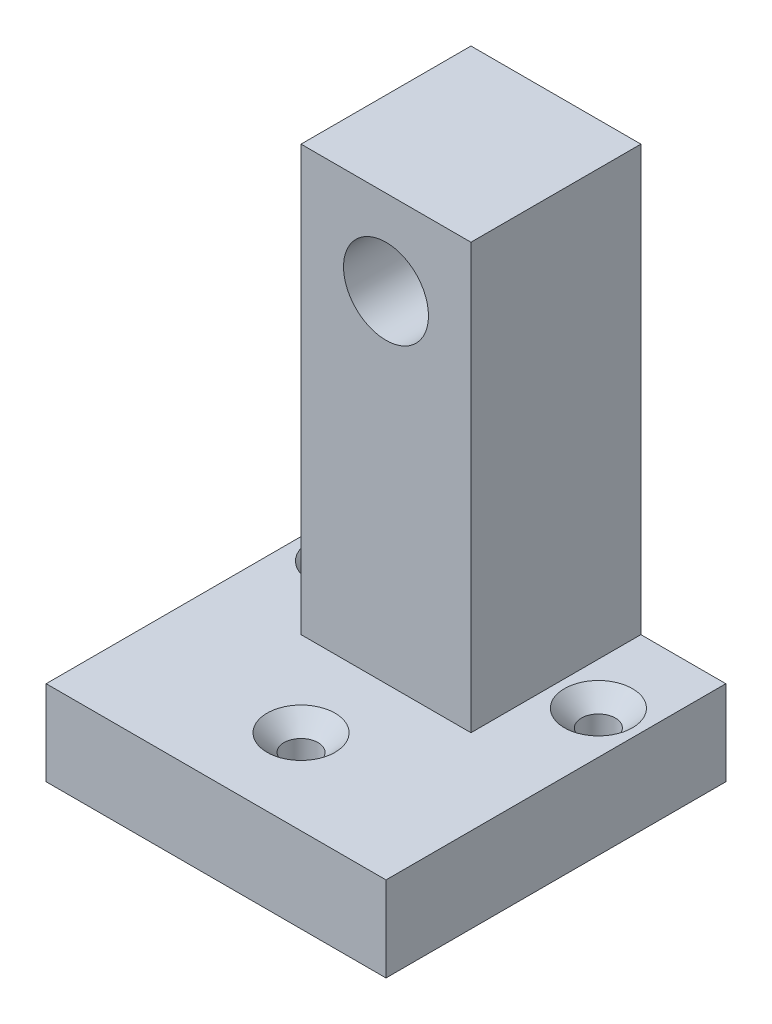
ISO-10303-21;
HEADER;
FILE_DESCRIPTION(('STEP AP214'),'2;1');
FILE_NAME('part.step','',(''),(''),'','','');
FILE_SCHEMA(('AUTOMOTIVE_DESIGN { 1 0 10303 214 1 1 1 1 }'));
ENDSEC;
DATA;
#1=APPLICATION_CONTEXT('core data for automotive mechanical design processes');
#2=APPLICATION_PROTOCOL_DEFINITION('international standard','automotive_design',2000,#1);
#3=PRODUCT_CONTEXT('',#1,'mechanical');
#4=PRODUCT('Part','Part','',(#3));
#5=PRODUCT_RELATED_PRODUCT_CATEGORY('part','',(#4));
#6=PRODUCT_DEFINITION_FORMATION('','',#4);
#7=PRODUCT_DEFINITION_CONTEXT('part definition',#1,'design');
#8=PRODUCT_DEFINITION('design','',#6,#7);
#9=PRODUCT_DEFINITION_SHAPE('','',#8);
#10=(LENGTH_UNIT() NAMED_UNIT(*) SI_UNIT(.MILLI.,.METRE.));
#11=(NAMED_UNIT(*) PLANE_ANGLE_UNIT() SI_UNIT($,.RADIAN.));
#12=(NAMED_UNIT(*) SI_UNIT($,.STERADIAN.) SOLID_ANGLE_UNIT());
#13=UNCERTAINTY_MEASURE_WITH_UNIT(LENGTH_MEASURE(1.E-05),#10,'distance_accuracy_value','');
#14=(GEOMETRIC_REPRESENTATION_CONTEXT(3) GLOBAL_UNCERTAINTY_ASSIGNED_CONTEXT((#13)) GLOBAL_UNIT_ASSIGNED_CONTEXT((#10,
#11,#12)) REPRESENTATION_CONTEXT('',''));
#15=CARTESIAN_POINT('',(0.,0.,0.));
#16=DIRECTION('',(0.,0.,1.));
#17=DIRECTION('',(1.,0.,0.));
#18=AXIS2_PLACEMENT_3D('',#15,#16,#17);
#19=CARTESIAN_POINT('',(-1.95424017064453,6.,2.));
#20=DIRECTION('',(0.,-1.,0.));
#21=DIRECTION('',(0.,0.,-1.));
#22=AXIS2_PLACEMENT_3D('',#19,#20,#21);
#23=PLANE('',#22);
#24=DIRECTION('',(-1.,0.,0.));
#25=VECTOR('',#24,1.);
#26=CARTESIAN_POINT('',(-1.95424017064453,6.,0.));
#27=LINE('',#26,#25);
#28=CARTESIAN_POINT('',(-1.95424017064453,6.,0.));
#29=VERTEX_POINT('',#28);
#30=CARTESIAN_POINT('',(-3.95424017064453,6.,0.));
#31=VERTEX_POINT('',#30);
#32=EDGE_CURVE('E142',#29,#31,#27,.T.);
#33=ORIENTED_EDGE('',*,*,#32,.T.);
#34=DIRECTION('',(0.,0.,-1.));
#35=VECTOR('',#34,1.);
#36=CARTESIAN_POINT('',(-3.95424017064453,6.,2.));
#37=LINE('',#36,#35);
#38=CARTESIAN_POINT('',(-3.95424017064453,6.,2.));
#39=VERTEX_POINT('',#38);
#40=EDGE_CURVE('E167',#39,#31,#37,.T.);
#41=ORIENTED_EDGE('',*,*,#40,.F.);
#42=DIRECTION('',(-1.,0.,0.));
#43=VECTOR('',#42,1.);
#44=CARTESIAN_POINT('',(-1.95424017064453,6.,2.));
#45=LINE('',#44,#43);
#46=CARTESIAN_POINT('',(-1.95424017064453,6.,2.));
#47=VERTEX_POINT('',#46);
#48=EDGE_CURVE('E143',#47,#39,#45,.T.);
#49=ORIENTED_EDGE('',*,*,#48,.F.);
#50=DIRECTION('',(0.,0.,-1.));
#51=VECTOR('',#50,1.);
#52=CARTESIAN_POINT('',(-1.95424017064453,6.,2.));
#53=LINE('',#52,#51);
#54=EDGE_CURVE('E158',#47,#29,#53,.T.);
#55=ORIENTED_EDGE('',*,*,#54,.T.);
#56=EDGE_LOOP('',(#33,#41,#49,#55));
#57=FACE_BOUND('',#56,.T.);
#58=ADVANCED_FACE('F32',(#57),#23,.F.);
#59=CARTESIAN_POINT('',(-3.95424017064453,6.,2.));
#60=DIRECTION('',(1.,0.,0.));
#61=DIRECTION('',(0.,1.,0.));
#62=AXIS2_PLACEMENT_3D('',#59,#60,#61);
#63=PLANE('',#62);
#64=CARTESIAN_POINT('',(-3.95424017064453,5.,1.));
#65=DIRECTION('',(-1.,0.,0.));
#66=DIRECTION('',(0.,-1.,0.));
#67=AXIS2_PLACEMENT_3D('',#64,#65,#66);
#68=CIRCLE('',#67,0.2);
#69=CARTESIAN_POINT('',(-3.95424017064453,4.8,1.));
#70=VERTEX_POINT('',#69);
#71=EDGE_CURVE('E194',#70,#70,#68,.T.);
#72=ORIENTED_EDGE('',*,*,#71,.F.);
#73=EDGE_LOOP('',(#72));
#74=FACE_BOUND('',#73,.T.);
#75=DIRECTION('',(0.,-1.,0.));
#76=VECTOR('',#75,1.);
#77=CARTESIAN_POINT('',(-3.95424017064453,6.,0.));
#78=LINE('',#77,#76);
#79=CARTESIAN_POINT('',(-3.95424017064453,1.,0.));
#80=VERTEX_POINT('',#79);
#81=EDGE_CURVE('E147',#31,#80,#78,.T.);
#82=ORIENTED_EDGE('',*,*,#81,.T.);
#83=DIRECTION('',(0.,0.,-1.));
#84=VECTOR('',#83,1.);
#85=CARTESIAN_POINT('',(-3.95424017064453,1.,2.));
#86=LINE('',#85,#84);
#87=CARTESIAN_POINT('',(-3.95424017064453,1.,2.));
#88=VERTEX_POINT('',#87);
#89=EDGE_CURVE('E118',#88,#80,#86,.T.);
#90=ORIENTED_EDGE('',*,*,#89,.F.);
#91=DIRECTION('',(0.,-1.,0.));
#92=VECTOR('',#91,1.);
#93=CARTESIAN_POINT('',(-3.95424017064453,6.,2.));
#94=LINE('',#93,#92);
#95=EDGE_CURVE('E93',#39,#88,#94,.T.);
#96=ORIENTED_EDGE('',*,*,#95,.F.);
#97=ORIENTED_EDGE('',*,*,#40,.T.);
#98=EDGE_LOOP('',(#82,#90,#96,#97));
#99=FACE_BOUND('',#98,.T.);
#100=ADVANCED_FACE('F225',(#74,#99),#63,.F.);
#101=CARTESIAN_POINT('',(-4.95424017064453,1.,2.));
#102=DIRECTION('',(1.,0.,0.));
#103=DIRECTION('',(0.,0.,-1.));
#104=AXIS2_PLACEMENT_3D('',#101,#102,#103);
#105=PLANE('',#104);
#106=DIRECTION('',(0.,-1.,0.));
#107=VECTOR('',#106,1.);
#108=CARTESIAN_POINT('',(-4.95424017064453,1.,0.));
#109=LINE('',#108,#107);
#110=CARTESIAN_POINT('',(-4.95424017064453,1.,0.));
#111=VERTEX_POINT('',#110);
#112=CARTESIAN_POINT('',(-4.95424017064453,0.,0.));
#113=VERTEX_POINT('',#112);
#114=EDGE_CURVE('E150',#111,#113,#109,.T.);
#115=ORIENTED_EDGE('',*,*,#114,.T.);
#116=DIRECTION('',(0.,0.,-1.));
#117=VECTOR('',#116,1.);
#118=CARTESIAN_POINT('',(-4.95424017064453,0.,2.));
#119=LINE('',#118,#117);
#120=CARTESIAN_POINT('',(-4.95424017064453,0.,4.));
#121=VERTEX_POINT('',#120);
#122=EDGE_CURVE('E119',#121,#113,#119,.T.);
#123=ORIENTED_EDGE('',*,*,#122,.F.);
#124=DIRECTION('',(0.,-1.,0.));
#125=VECTOR('',#124,1.);
#126=CARTESIAN_POINT('',(-4.95424017064453,0.,4.));
#127=LINE('',#126,#125);
#128=CARTESIAN_POINT('',(-4.95424017064453,1.,4.));
#129=VERTEX_POINT('',#128);
#130=EDGE_CURVE('E122',#129,#121,#127,.T.);
#131=ORIENTED_EDGE('',*,*,#130,.F.);
#132=DIRECTION('',(0.,0.,-1.));
#133=VECTOR('',#132,1.);
#134=CARTESIAN_POINT('',(-4.95424017064453,1.,2.));
#135=LINE('',#134,#133);
#136=EDGE_CURVE('E107',#129,#111,#135,.T.);
#137=ORIENTED_EDGE('',*,*,#136,.T.);
#138=EDGE_LOOP('',(#115,#123,#131,#137));
#139=FACE_BOUND('',#138,.T.);
#140=ADVANCED_FACE('F123',(#139),#105,.F.);
#141=CARTESIAN_POINT('',(-4.95424017064453,0.,2.));
#142=DIRECTION('',(0.,1.,0.));
#143=DIRECTION('',(0.,0.,1.));
#144=AXIS2_PLACEMENT_3D('',#141,#142,#143);
#145=PLANE('',#144);
#146=CARTESIAN_POINT('',(-2.95424017064453,0.,3.));
#147=DIRECTION('',(0.,1.,0.));
#148=DIRECTION('',(-1.,0.,0.));
#149=AXIS2_PLACEMENT_3D('',#146,#147,#148);
#150=CIRCLE('',#149,0.2);
#151=CARTESIAN_POINT('',(-3.15424017064453,0.,3.));
#152=VERTEX_POINT('',#151);
#153=EDGE_CURVE('E264',#152,#152,#150,.T.);
#154=ORIENTED_EDGE('',*,*,#153,.T.);
#155=EDGE_LOOP('',(#154));
#156=FACE_BOUND('',#155,.T.);
#157=CARTESIAN_POINT('',(-1.45424017064453,0.,1.));
#158=DIRECTION('',(0.,1.,0.));
#159=DIRECTION('',(-1.,0.,0.));
#160=AXIS2_PLACEMENT_3D('',#157,#158,#159);
#161=CIRCLE('',#160,0.2);
#162=CARTESIAN_POINT('',(-1.65424017064453,0.,1.));
#163=VERTEX_POINT('',#162);
#164=EDGE_CURVE('E259',#163,#163,#161,.T.);
#165=ORIENTED_EDGE('',*,*,#164,.T.);
#166=EDGE_LOOP('',(#165));
#167=FACE_BOUND('',#166,.T.);
#168=CARTESIAN_POINT('',(-4.45424017064453,0.,1.));
#169=DIRECTION('',(0.,1.,0.));
#170=DIRECTION('',(-1.,0.,0.));
#171=AXIS2_PLACEMENT_3D('',#168,#169,#170);
#172=CIRCLE('',#171,0.2);
#173=CARTESIAN_POINT('',(-4.65424017064453,0.,1.));
#174=VERTEX_POINT('',#173);
#175=EDGE_CURVE('E257',#174,#174,#172,.T.);
#176=ORIENTED_EDGE('',*,*,#175,.T.);
#177=EDGE_LOOP('',(#176));
#178=FACE_BOUND('',#177,.T.);
#179=DIRECTION('',(1.,0.,0.));
#180=VECTOR('',#179,1.);
#181=CARTESIAN_POINT('',(-4.95424017064453,0.,0.));
#182=LINE('',#181,#180);
#183=CARTESIAN_POINT('',(-0.95424017064453,0.,0.));
#184=VERTEX_POINT('',#183);
#185=EDGE_CURVE('E152',#113,#184,#182,.T.);
#186=ORIENTED_EDGE('',*,*,#185,.T.);
#187=DIRECTION('',(0.,0.,-1.));
#188=VECTOR('',#187,1.);
#189=CARTESIAN_POINT('',(-0.95424017064453,0.,2.));
#190=LINE('',#189,#188);
#191=CARTESIAN_POINT('',(-0.95424017064453,0.,4.));
#192=VERTEX_POINT('',#191);
#193=EDGE_CURVE('E163',#192,#184,#190,.T.);
#194=ORIENTED_EDGE('',*,*,#193,.F.);
#195=DIRECTION('',(1.,0.,0.));
#196=VECTOR('',#195,1.);
#197=CARTESIAN_POINT('',(-0.95424017064453,0.,4.));
#198=LINE('',#197,#196);
#199=EDGE_CURVE('E128',#121,#192,#198,.T.);
#200=ORIENTED_EDGE('',*,*,#199,.F.);
#201=ORIENTED_EDGE('',*,*,#122,.T.);
#202=EDGE_LOOP('',(#186,#194,#200,#201));
#203=FACE_BOUND('',#202,.T.);
#204=ADVANCED_FACE('F270',(#156,#167,#178,#203),#145,.F.);
#205=CARTESIAN_POINT('',(-0.95424017064453,0.,2.));
#206=DIRECTION('',(-1.,0.,0.));
#207=DIRECTION('',(0.,-1.,0.));
#208=AXIS2_PLACEMENT_3D('',#205,#206,#207);
#209=PLANE('',#208);
#210=DIRECTION('',(0.,1.,0.));
#211=VECTOR('',#210,1.);
#212=CARTESIAN_POINT('',(-0.95424017064453,0.,0.));
#213=LINE('',#212,#211);
#214=CARTESIAN_POINT('',(-0.95424017064453,1.,0.));
#215=VERTEX_POINT('',#214);
#216=EDGE_CURVE('E154',#184,#215,#213,.T.);
#217=ORIENTED_EDGE('',*,*,#216,.T.);
#218=DIRECTION('',(0.,0.,-1.));
#219=VECTOR('',#218,1.);
#220=CARTESIAN_POINT('',(-0.95424017064453,1.,2.));
#221=LINE('',#220,#219);
#222=CARTESIAN_POINT('',(-0.95424017064453,1.,4.));
#223=VERTEX_POINT('',#222);
#224=EDGE_CURVE('E161',#223,#215,#221,.T.);
#225=ORIENTED_EDGE('',*,*,#224,.F.);
#226=DIRECTION('',(0.,1.,0.));
#227=VECTOR('',#226,1.);
#228=CARTESIAN_POINT('',(-0.95424017064453,1.,4.));
#229=LINE('',#228,#227);
#230=EDGE_CURVE('E132',#192,#223,#229,.T.);
#231=ORIENTED_EDGE('',*,*,#230,.F.);
#232=ORIENTED_EDGE('',*,*,#193,.T.);
#233=EDGE_LOOP('',(#217,#225,#231,#232));
#234=FACE_BOUND('',#233,.T.);
#235=ADVANCED_FACE('F273',(#234),#209,.F.);
#236=CARTESIAN_POINT('',(-0.95424017064453,1.,2.));
#237=DIRECTION('',(0.,-1.,0.));
#238=DIRECTION('',(1.,0.,0.));
#239=AXIS2_PLACEMENT_3D('',#236,#237,#238);
#240=PLANE('',#239);
#241=CARTESIAN_POINT('',(-4.45424017064453,0.999999999999999,1.));
#242=DIRECTION('',(0.,-1.,0.));
#243=DIRECTION('',(1.,0.,0.));
#244=AXIS2_PLACEMENT_3D('',#241,#242,#243);
#245=CIRCLE('',#244,0.400000000000003);
#246=CARTESIAN_POINT('',(-4.05424017064453,0.999999999999999,1.));
#247=VERTEX_POINT('',#246);
#248=EDGE_CURVE('E11',#247,#247,#245,.T.);
#249=ORIENTED_EDGE('',*,*,#248,.T.);
#250=EDGE_LOOP('',(#249));
#251=FACE_BOUND('',#250,.T.);
#252=CARTESIAN_POINT('',(-1.45424017064453,1.,1.));
#253=DIRECTION('',(0.,-1.,0.));
#254=DIRECTION('',(1.,0.,0.));
#255=AXIS2_PLACEMENT_3D('',#252,#253,#254);
#256=CIRCLE('',#255,0.400000000000001);
#257=CARTESIAN_POINT('',(-1.05424017064453,1.,1.));
#258=VERTEX_POINT('',#257);
#259=EDGE_CURVE('E243',#258,#258,#256,.T.);
#260=ORIENTED_EDGE('',*,*,#259,.T.);
#261=EDGE_LOOP('',(#260));
#262=FACE_BOUND('',#261,.T.);
#263=CARTESIAN_POINT('',(-2.95424017064453,0.999999999999999,3.));
#264=DIRECTION('',(0.,-1.,0.));
#265=DIRECTION('',(1.,0.,0.));
#266=AXIS2_PLACEMENT_3D('',#263,#264,#265);
#267=CIRCLE('',#266,0.400000000000001);
#268=CARTESIAN_POINT('',(-2.55424017064453,0.999999999999999,3.));
#269=VERTEX_POINT('',#268);
#270=EDGE_CURVE('E247',#269,#269,#267,.T.);
#271=ORIENTED_EDGE('',*,*,#270,.T.);
#272=EDGE_LOOP('',(#271));
#273=FACE_BOUND('',#272,.T.);
#274=DIRECTION('',(-1.,0.,0.));
#275=VECTOR('',#274,1.);
#276=CARTESIAN_POINT('',(-0.95424017064453,1.,0.));
#277=LINE('',#276,#275);
#278=CARTESIAN_POINT('',(-1.95424017064453,1.,0.));
#279=VERTEX_POINT('',#278);
#280=EDGE_CURVE('E79',#215,#279,#277,.T.);
#281=ORIENTED_EDGE('',*,*,#280,.T.);
#282=DIRECTION('',(0.,0.,-1.));
#283=VECTOR('',#282,1.);
#284=CARTESIAN_POINT('',(-1.95424017064453,1.,2.));
#285=LINE('',#284,#283);
#286=CARTESIAN_POINT('',(-1.95424017064453,1.,2.));
#287=VERTEX_POINT('',#286);
#288=EDGE_CURVE('E160',#287,#279,#285,.T.);
#289=ORIENTED_EDGE('',*,*,#288,.F.);
#290=DIRECTION('',(-1.,0.,0.));
#291=VECTOR('',#290,1.);
#292=CARTESIAN_POINT('',(-3.95424017064453,1.,2.));
#293=LINE('',#292,#291);
#294=EDGE_CURVE('E169',#287,#88,#293,.T.);
#295=ORIENTED_EDGE('',*,*,#294,.T.);
#296=ORIENTED_EDGE('',*,*,#89,.T.);
#297=DIRECTION('',(-1.,0.,0.));
#298=VECTOR('',#297,1.);
#299=CARTESIAN_POINT('',(-3.95424017064453,1.,0.));
#300=LINE('',#299,#298);
#301=EDGE_CURVE('E115',#80,#111,#300,.T.);
#302=ORIENTED_EDGE('',*,*,#301,.T.);
#303=ORIENTED_EDGE('',*,*,#136,.F.);
#304=DIRECTION('',(-1.,0.,0.));
#305=VECTOR('',#304,1.);
#306=CARTESIAN_POINT('',(-4.95424017064453,1.,4.));
#307=LINE('',#306,#305);
#308=EDGE_CURVE('E111',#223,#129,#307,.T.);
#309=ORIENTED_EDGE('',*,*,#308,.F.);
#310=ORIENTED_EDGE('',*,*,#224,.T.);
#311=EDGE_LOOP('',(#281,#289,#295,#296,#302,#303,#309,#310));
#312=FACE_BOUND('',#311,.T.);
#313=ADVANCED_FACE('F109',(#251,#262,#273,#312),#240,.F.);
#314=CARTESIAN_POINT('',(-1.95424017064453,1.,2.));
#315=DIRECTION('',(-1.,0.,0.));
#316=DIRECTION('',(0.,0.,1.));
#317=AXIS2_PLACEMENT_3D('',#314,#315,#316);
#318=PLANE('',#317);
#319=DIRECTION('',(0.,1.,0.));
#320=VECTOR('',#319,1.);
#321=CARTESIAN_POINT('',(-1.95424017064453,1.,0.));
#322=LINE('',#321,#320);
#323=EDGE_CURVE('E85',#279,#29,#322,.T.);
#324=ORIENTED_EDGE('',*,*,#323,.T.);
#325=ORIENTED_EDGE('',*,*,#54,.F.);
#326=DIRECTION('',(0.,1.,0.));
#327=VECTOR('',#326,1.);
#328=CARTESIAN_POINT('',(-1.95424017064453,1.,2.));
#329=LINE('',#328,#327);
#330=EDGE_CURVE('E49',#287,#47,#329,.T.);
#331=ORIENTED_EDGE('',*,*,#330,.F.);
#332=ORIENTED_EDGE('',*,*,#288,.T.);
#333=EDGE_LOOP('',(#324,#325,#331,#332));
#334=FACE_BOUND('',#333,.T.);
#335=ADVANCED_FACE('F285',(#334),#318,.F.);
#336=CARTESIAN_POINT('',(0.,0.,2.));
#337=DIRECTION('',(0.,0.,1.));
#338=DIRECTION('',(1.,0.,0.));
#339=AXIS2_PLACEMENT_3D('',#336,#337,#338);
#340=PLANE('',#339);
#341=CARTESIAN_POINT('',(-2.95424017064453,5.,2.));
#342=DIRECTION('',(0.,0.,1.));
#343=DIRECTION('',(1.,0.,0.));
#344=AXIS2_PLACEMENT_3D('',#341,#342,#343);
#345=CIRCLE('',#344,0.5);
#346=CARTESIAN_POINT('',(-2.45424017064453,5.,2.));
#347=VERTEX_POINT('',#346);
#348=EDGE_CURVE('E136',#347,#347,#345,.T.);
#349=ORIENTED_EDGE('',*,*,#348,.F.);
#350=EDGE_LOOP('',(#349));
#351=FACE_BOUND('',#350,.T.);
#352=ORIENTED_EDGE('',*,*,#294,.F.);
#353=ORIENTED_EDGE('',*,*,#330,.T.);
#354=ORIENTED_EDGE('',*,*,#48,.T.);
#355=ORIENTED_EDGE('',*,*,#95,.T.);
#356=EDGE_LOOP('',(#352,#353,#354,#355));
#357=FACE_BOUND('',#356,.T.);
#358=ADVANCED_FACE('F286',(#351,#357),#340,.T.);
#359=CARTESIAN_POINT('',(0.,0.,0.));
#360=DIRECTION('',(0.,0.,1.));
#361=DIRECTION('',(1.,0.,0.));
#362=AXIS2_PLACEMENT_3D('',#359,#360,#361);
#363=PLANE('',#362);
#364=CARTESIAN_POINT('',(-2.95424017064453,5.,0.));
#365=DIRECTION('',(0.,0.,1.));
#366=DIRECTION('',(1.,0.,0.));
#367=AXIS2_PLACEMENT_3D('',#364,#365,#366);
#368=CIRCLE('',#367,0.5);
#369=CARTESIAN_POINT('',(-2.45424017064453,5.,0.));
#370=VERTEX_POINT('',#369);
#371=EDGE_CURVE('E133',#370,#370,#368,.T.);
#372=ORIENTED_EDGE('',*,*,#371,.T.);
#373=EDGE_LOOP('',(#372));
#374=FACE_BOUND('',#373,.T.);
#375=ORIENTED_EDGE('',*,*,#32,.F.);
#376=ORIENTED_EDGE('',*,*,#323,.F.);
#377=ORIENTED_EDGE('',*,*,#280,.F.);
#378=ORIENTED_EDGE('',*,*,#216,.F.);
#379=ORIENTED_EDGE('',*,*,#185,.F.);
#380=ORIENTED_EDGE('',*,*,#114,.F.);
#381=ORIENTED_EDGE('',*,*,#301,.F.);
#382=ORIENTED_EDGE('',*,*,#81,.F.);
#383=EDGE_LOOP('',(#375,#376,#377,#378,#379,#380,#381,#382));
#384=FACE_BOUND('',#383,.T.);
#385=ADVANCED_FACE('F282',(#374,#384),#363,.F.);
#386=CARTESIAN_POINT('',(0.,0.,4.));
#387=DIRECTION('',(0.,0.,-1.));
#388=DIRECTION('',(-1.,0.,0.));
#389=AXIS2_PLACEMENT_3D('',#386,#387,#388);
#390=PLANE('',#389);
#391=ORIENTED_EDGE('',*,*,#308,.T.);
#392=ORIENTED_EDGE('',*,*,#130,.T.);
#393=ORIENTED_EDGE('',*,*,#199,.T.);
#394=ORIENTED_EDGE('',*,*,#230,.T.);
#395=EDGE_LOOP('',(#391,#392,#393,#394));
#396=FACE_BOUND('',#395,.T.);
#397=ADVANCED_FACE('F130',(#396),#390,.F.);
#398=CARTESIAN_POINT('',(-2.95424017064453,5.,0.));
#399=DIRECTION('',(0.,0.,1.));
#400=DIRECTION('',(1.,0.,0.));
#401=AXIS2_PLACEMENT_3D('',#398,#399,#400);
#402=CYLINDRICAL_SURFACE('',#401,0.5);
#403=CARTESIAN_POINT('',(-3.41249774014011,4.8,1.));
#404=CARTESIAN_POINT('',(-3.41249882234721,4.80000117457824,1.01071394981329));
#405=CARTESIAN_POINT('',(-3.4128787731412,4.8008660181402,1.02144305347135));
#406=CARTESIAN_POINT('',(-3.41435108481993,4.8042930969411,1.04259348328682));
#407=CARTESIAN_POINT('',(-3.41544526602805,4.80685966955589,1.05301395170781));
#408=CARTESIAN_POINT('',(-3.41820062643914,4.81357649674303,1.07320529419724));
#409=CARTESIAN_POINT('',(-3.41985966700253,4.81772078474743,1.08297845473609));
#410=CARTESIAN_POINT('',(-3.42355483573892,4.82745797306287,1.1016885050859));
#411=CARTESIAN_POINT('',(-3.42559088154821,4.83305055707326,1.11062557691507));
#412=CARTESIAN_POINT('',(-3.42994103569582,4.84586780254125,1.12792604022416));
#413=CARTESIAN_POINT('',(-3.43226408860334,4.85316206422726,1.13623564229295));
#414=CARTESIAN_POINT('',(-3.43685262762327,4.8690290894226,1.15155289973153));
#415=CARTESIAN_POINT('',(-3.43911809338088,4.87760229783243,1.15856010012898));
#416=CARTESIAN_POINT('',(-3.4434435785514,4.89619936896436,1.17134063969827));
#417=CARTESIAN_POINT('',(-3.4454919743281,4.90626710343877,1.17705443014707));
#418=CARTESIAN_POINT('',(-3.44904409827607,4.92731746771249,1.18668435683898));
#419=CARTESIAN_POINT('',(-3.4505480480292,4.9382997230712,1.19060122457819));
#420=CARTESIAN_POINT('',(-3.45277849565281,4.96030335731611,1.19633414864374));
#421=CARTESIAN_POINT('',(-3.45353910741989,4.97129710151954,1.1982427314089));
#422=CARTESIAN_POINT('',(-3.45432048132723,4.99347336713624,1.20020284856627));
#423=CARTESIAN_POINT('',(-3.45434151941384,5.00465581658254,1.20025507559348));
#424=CARTESIAN_POINT('',(-3.45366213346632,5.02622324947153,1.1985517230225));
#425=CARTESIAN_POINT('',(-3.45300216741638,5.0366177452874,1.19689752272531));
#426=CARTESIAN_POINT('',(-3.4510894621133,5.05696731092183,1.19200071236893));
#427=CARTESIAN_POINT('',(-3.44983667936558,5.06692234843902,1.18875798575996));
#428=CARTESIAN_POINT('',(-3.44683699510229,5.08628979385117,1.18073635171237));
#429=CARTESIAN_POINT('',(-3.44508293111155,5.09569176233796,1.17593502851844));
#430=CARTESIAN_POINT('',(-3.441254755824,5.11358081507406,1.16495349930811));
#431=CARTESIAN_POINT('',(-3.43918053490876,5.12206758427161,1.15877282069026));
#432=CARTESIAN_POINT('',(-3.43476180782376,5.13847688279922,1.14473508640532));
#433=CARTESIAN_POINT('',(-3.43240849716822,5.14632578452737,1.13679461074152));
#434=CARTESIAN_POINT('',(-3.42780183160586,5.16061074153852,1.119700942818));
#435=CARTESIAN_POINT('',(-3.42554850960798,5.16704633437593,1.11054735518494));
#436=CARTESIAN_POINT('',(-3.4213370680996,5.17849041887433,1.09095809775874));
#437=CARTESIAN_POINT('',(-3.41938908487607,5.18345346517362,1.08049351695023));
#438=CARTESIAN_POINT('',(-3.41612776106173,5.1915176259965,1.05877845095519));
#439=CARTESIAN_POINT('',(-3.41481400838068,5.19461994983997,1.04752848152811));
#440=CARTESIAN_POINT('',(-3.41306993049342,5.19869549488229,1.02529642225888));
#441=CARTESIAN_POINT('',(-3.41259053773061,5.19978720968095,1.01433995528528));
#442=CARTESIAN_POINT('',(-3.41242966915392,5.20015613264506,0.992392279216648));
#443=CARTESIAN_POINT('',(-3.41274795137218,5.19943389105848,0.981401081666994));
#444=CARTESIAN_POINT('',(-3.41409621484633,5.19630328947857,0.960354106502403));
#445=CARTESIAN_POINT('',(-3.41508462840062,5.19399330620227,0.950280706259484));
#446=CARTESIAN_POINT('',(-3.41761022171409,5.18788041869121,0.930671159521965));
#447=CARTESIAN_POINT('',(-3.41914752314465,5.18407718343026,0.921135132689423));
#448=CARTESIAN_POINT('',(-3.42267395249264,5.17491356394812,0.902439764220291));
#449=CARTESIAN_POINT('',(-3.42467887528048,5.16949628682645,0.893311381130512));
#450=CARTESIAN_POINT('',(-3.42889055580555,5.15731652244419,0.876051701255877));
#451=CARTESIAN_POINT('',(-3.43109739554147,5.1505534873482,0.867920812720453));
#452=CARTESIAN_POINT('',(-3.43566108661498,5.13528442116805,0.852262659140066));
#453=CARTESIAN_POINT('',(-3.43801697792948,5.12668654294451,0.844824343470894));
#454=CARTESIAN_POINT('',(-3.44245996521234,5.10830836333689,0.83148229233897));
#455=CARTESIAN_POINT('',(-3.44454705023784,5.09852801384679,0.825578619340278));
#456=CARTESIAN_POINT('',(-3.44822388654475,5.07802799340018,0.815495237353876));
#457=CARTESIAN_POINT('',(-3.44981375688479,5.06730854809941,0.811315115583421));
#458=CARTESIAN_POINT('',(-3.45231288411384,5.04523935909192,0.804845114759237));
#459=CARTESIAN_POINT('',(-3.45322251035207,5.03388996102943,0.802554209855993));
#460=CARTESIAN_POINT('',(-3.45421917885504,5.01168165103463,0.800049529837462));
#461=CARTESIAN_POINT('',(-3.45435601738942,5.00083904925931,0.799709987153737));
#462=CARTESIAN_POINT('',(-3.4539262130231,4.97925661642668,0.800785547928408));
#463=CARTESIAN_POINT('',(-3.45335967661136,4.96851677006054,0.802200385778554));
#464=CARTESIAN_POINT('',(-3.45161168400886,4.94778290980536,0.806654678835856));
#465=CARTESIAN_POINT('',(-3.45044965127914,4.93777611953515,0.809642894607584));
#466=CARTESIAN_POINT('',(-3.44763511847629,4.91840776452412,0.817105280456153));
#467=CARTESIAN_POINT('',(-3.4459825279475,4.90904631917331,0.821579724601927));
#468=CARTESIAN_POINT('',(-3.44225826500567,4.89077969581435,0.832110319849047));
#469=CARTESIAN_POINT('',(-3.44017130037688,4.8819129613192,0.838227629488936));
#470=CARTESIAN_POINT('',(-3.43582957382685,4.86529459714775,0.851778851917465));
#471=CARTESIAN_POINT('',(-3.43357474267961,4.857543431426,0.859213309644412));
#472=CARTESIAN_POINT('',(-3.42897793422033,4.84287987349079,0.875731522454204));
#473=CARTESIAN_POINT('',(-3.42663920331279,4.83604911127775,0.884888887346633));
#474=CARTESIAN_POINT('',(-3.42228984205682,4.82401525495841,0.904294213736354));
#475=CARTESIAN_POINT('',(-3.42027925029679,4.81881235221879,0.914542303266591));
#476=CARTESIAN_POINT('',(-3.41699903531753,4.81060089122722,0.934903720200696));
#477=CARTESIAN_POINT('',(-3.41567909002365,4.8074372485591,0.944946523541468));
#478=CARTESIAN_POINT('',(-3.4136861749689,4.8027282241944,0.965448542029543));
#479=CARTESIAN_POINT('',(-3.41301140284085,4.80117833320697,0.97590651161315));
#480=CARTESIAN_POINT('',(-3.41256462934868,4.80015357417058,0.990937756229981));
#481=CARTESIAN_POINT('',(-3.41249728231831,4.7999995031011,0.995467522098365));
#482=CARTESIAN_POINT('',(-3.41249774014011,4.8,1.));
#483=B_SPLINE_CURVE_WITH_KNOTS('',3,(#403,#404,#405,#406,#407,#408,#409,#410,#411,#412,#413,
#414,#415,#416,#417,#418,#419,#420,#421,#422,#423,#424,#425,#426,#427,#428,#429,#430,#431,#432,
#433,#434,#435,#436,#437,#438,#439,#440,#441,#442,#443,#444,#445,#446,#447,#448,#449,#450,#451,
#452,#453,#454,#455,#456,#457,#458,#459,#460,#461,#462,#463,#464,#465,#466,#467,#468,#469,#470,
#471,#472,#473,#474,#475,#476,#477,#478,#479,#480,#481,#482),.UNSPECIFIED.,.T.,.F.,(4,2,2,2,2,2,
2,2,2,2,2,2,2,2,2,2,2,2,2,2,2,2,2,2,2,2,2,2,2,2,2,2,2,2,2,2,2,2,2,4),(0.,0.0321277648767655,
0.0643377335822245,0.0964270823293386,0.128509428823861,0.162255618284424,0.196013574348342,
0.231102669091428,0.266177466969481,0.299554182887184,0.332918445305671,0.364408644830302,
0.39590115512906,0.427868300234898,0.459846414940031,0.493924044081356,0.528012807127127,
0.563064458714576,0.598093304794111,0.630982147495955,0.663861014856835,0.69486724803404,
0.725880358600533,0.758151154601597,0.790435114474745,0.825103734195875,0.859773764801644,
0.894435487261709,0.929078375903032,0.961461039704849,0.993838801461498,1.02522199439225,
1.05661097777748,1.08938705108882,1.1221767165131,1.15699625323451,1.19181988170808,
1.22351666074734,1.25512463012468,1.26871610543216),.UNSPECIFIED.);
#484=CARTESIAN_POINT('',(-3.41249774014011,4.8,1.));
#485=VERTEX_POINT('',#484);
#486=EDGE_CURVE('E187',#485,#485,#483,.T.);
#487=ORIENTED_EDGE('',*,*,#486,.T.);
#488=EDGE_LOOP('',(#487));
#489=FACE_BOUND('',#488,.T.);
#490=ORIENTED_EDGE('',*,*,#371,.F.);
#491=EDGE_LOOP('',(#490));
#492=FACE_BOUND('',#491,.T.);
#493=ORIENTED_EDGE('',*,*,#348,.T.);
#494=EDGE_LOOP('',(#493));
#495=FACE_BOUND('',#494,.T.);
#496=ADVANCED_FACE('F196',(#489,#492,#495),#402,.F.);
#497=CARTESIAN_POINT('',(-2.95424017064453,5.,1.));
#498=DIRECTION('',(-1.,0.,0.));
#499=DIRECTION('',(0.,-1.,0.));
#500=AXIS2_PLACEMENT_3D('',#497,#498,#499);
#501=CYLINDRICAL_SURFACE('',#500,0.2);
#502=ORIENTED_EDGE('',*,*,#71,.T.);
#503=EDGE_LOOP('',(#502));
#504=FACE_BOUND('',#503,.T.);
#505=ORIENTED_EDGE('',*,*,#486,.F.);
#506=EDGE_LOOP('',(#505));
#507=FACE_BOUND('',#506,.T.);
#508=ADVANCED_FACE('F199',(#504,#507),#501,.F.);
#509=CARTESIAN_POINT('',(-4.45424017064453,0.,1.));
#510=DIRECTION('',(0.,1.,0.));
#511=DIRECTION('',(-1.,0.,0.));
#512=AXIS2_PLACEMENT_3D('',#509,#510,#511);
#513=CYLINDRICAL_SURFACE('',#512,0.2);
#514=CARTESIAN_POINT('',(-4.45424017064453,0.799999999999998,1.));
#515=DIRECTION('',(0.,-1.,0.));
#516=DIRECTION('',(1.,0.,0.));
#517=AXIS2_PLACEMENT_3D('',#514,#515,#516);
#518=CIRCLE('',#517,0.2);
#519=CARTESIAN_POINT('',(-4.25424017064453,0.799999999999999,1.));
#520=VERTEX_POINT('',#519);
#521=EDGE_CURVE('E41',#520,#520,#518,.F.);
#522=ORIENTED_EDGE('',*,*,#521,.T.);
#523=EDGE_LOOP('',(#522));
#524=FACE_BOUND('',#523,.T.);
#525=ORIENTED_EDGE('',*,*,#175,.F.);
#526=EDGE_LOOP('',(#525));
#527=FACE_BOUND('',#526,.T.);
#528=ADVANCED_FACE('F203',(#524,#527),#513,.F.);
#529=CARTESIAN_POINT('',(-1.45424017064453,0.,1.));
#530=DIRECTION('',(0.,1.,0.));
#531=DIRECTION('',(-1.,0.,0.));
#532=AXIS2_PLACEMENT_3D('',#529,#530,#531);
#533=CYLINDRICAL_SURFACE('',#532,0.2);
#534=CARTESIAN_POINT('',(-1.45424017064453,0.799999999999999,1.));
#535=DIRECTION('',(0.,-1.,0.));
#536=DIRECTION('',(0.,0.,-1.));
#537=AXIS2_PLACEMENT_3D('',#534,#535,#536);
#538=CIRCLE('',#537,0.2);
#539=CARTESIAN_POINT('',(-1.45424017064453,0.799999999999999,0.8));
#540=VERTEX_POINT('',#539);
#541=EDGE_CURVE('E246',#540,#540,#538,.F.);
#542=ORIENTED_EDGE('',*,*,#541,.T.);
#543=EDGE_LOOP('',(#542));
#544=FACE_BOUND('',#543,.T.);
#545=ORIENTED_EDGE('',*,*,#164,.F.);
#546=EDGE_LOOP('',(#545));
#547=FACE_BOUND('',#546,.T.);
#548=ADVANCED_FACE('F207',(#544,#547),#533,.F.);
#549=CARTESIAN_POINT('',(-2.95424017064453,0.,3.));
#550=DIRECTION('',(0.,1.,0.));
#551=DIRECTION('',(-1.,0.,0.));
#552=AXIS2_PLACEMENT_3D('',#549,#550,#551);
#553=CYLINDRICAL_SURFACE('',#552,0.2);
#554=CARTESIAN_POINT('',(-2.95424017064453,0.799999999999999,3.));
#555=DIRECTION('',(0.,-1.,0.));
#556=DIRECTION('',(0.,0.,-1.));
#557=AXIS2_PLACEMENT_3D('',#554,#555,#556);
#558=CIRCLE('',#557,0.2);
#559=CARTESIAN_POINT('',(-2.95424017064453,0.799999999999999,2.8));
#560=VERTEX_POINT('',#559);
#561=EDGE_CURVE('E174',#560,#560,#558,.F.);
#562=ORIENTED_EDGE('',*,*,#561,.T.);
#563=EDGE_LOOP('',(#562));
#564=FACE_BOUND('',#563,.T.);
#565=ORIENTED_EDGE('',*,*,#153,.F.);
#566=EDGE_LOOP('',(#565));
#567=FACE_BOUND('',#566,.T.);
#568=ADVANCED_FACE('F211',(#564,#567),#553,.F.);
#569=CARTESIAN_POINT('',(-2.95424017064453,0.799999999999999,3.));
#570=DIRECTION('',(0.,1.,0.));
#571=DIRECTION('',(0.,0.,1.));
#572=AXIS2_PLACEMENT_3D('',#569,#570,#571);
#573=CONICAL_SURFACE('',#572,0.2,0.78539816339745);
#574=ORIENTED_EDGE('',*,*,#270,.F.);
#575=EDGE_LOOP('',(#574));
#576=FACE_BOUND('',#575,.T.);
#577=ORIENTED_EDGE('',*,*,#561,.F.);
#578=EDGE_LOOP('',(#577));
#579=FACE_BOUND('',#578,.T.);
#580=ADVANCED_FACE('F214',(#576,#579),#573,.F.);
#581=CARTESIAN_POINT('',(-1.45424017064453,0.8,1.));
#582=DIRECTION('',(0.,1.,0.));
#583=DIRECTION('',(0.,0.,1.));
#584=AXIS2_PLACEMENT_3D('',#581,#582,#583);
#585=CONICAL_SURFACE('',#584,0.2,0.78539816339745);
#586=ORIENTED_EDGE('',*,*,#259,.F.);
#587=EDGE_LOOP('',(#586));
#588=FACE_BOUND('',#587,.T.);
#589=ORIENTED_EDGE('',*,*,#541,.F.);
#590=EDGE_LOOP('',(#589));
#591=FACE_BOUND('',#590,.T.);
#592=ADVANCED_FACE('F219',(#588,#591),#585,.F.);
#593=CARTESIAN_POINT('',(-4.45424017064453,0.799999999999998,1.));
#594=DIRECTION('',(0.,1.,0.));
#595=DIRECTION('',(-1.,0.,0.));
#596=AXIS2_PLACEMENT_3D('',#593,#594,#595);
#597=CONICAL_SURFACE('',#596,0.2,0.785398163397451);
#598=ORIENTED_EDGE('',*,*,#248,.F.);
#599=EDGE_LOOP('',(#598));
#600=FACE_BOUND('',#599,.T.);
#601=ORIENTED_EDGE('',*,*,#521,.F.);
#602=EDGE_LOOP('',(#601));
#603=FACE_BOUND('',#602,.T.);
#604=ADVANCED_FACE('F34',(#600,#603),#597,.F.);
#605=CLOSED_SHELL('',(#58,#100,#140,#204,#235,#313,#335,#358,#385,#397,#496,#508,#528,#548,#568,
#580,#592,#604));
#606=MANIFOLD_SOLID_BREP('B2',#605);
#607=ADVANCED_BREP_SHAPE_REPRESENTATION('',(#18,#606),#14);
#608=SHAPE_DEFINITION_REPRESENTATION(#9,#607);
ENDSEC;
END-ISO-10303-21;
